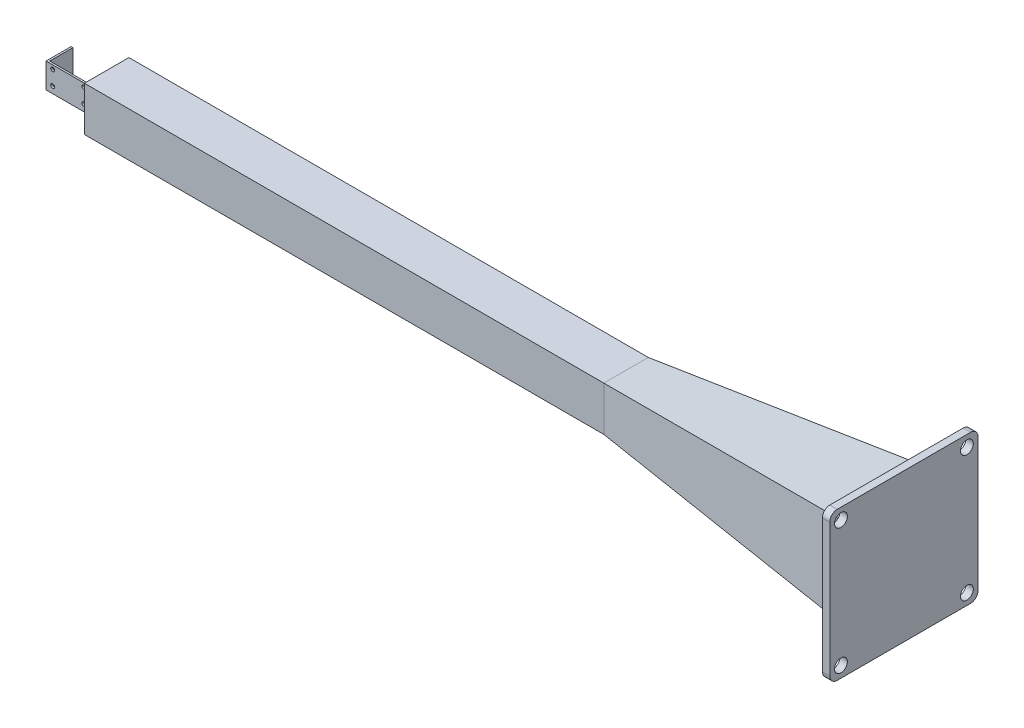
ISO-10303-21;
HEADER;
FILE_DESCRIPTION(('STEP AP214'),'2;1');
FILE_NAME('part.step','',(''),(''),'','','');
FILE_SCHEMA(('AUTOMOTIVE_DESIGN { 1 0 10303 214 1 1 1 1 }'));
ENDSEC;
DATA;
#1=APPLICATION_CONTEXT('core data for automotive mechanical design processes');
#2=APPLICATION_PROTOCOL_DEFINITION('international standard','automotive_design',2000,#1);
#3=PRODUCT_CONTEXT('',#1,'mechanical');
#4=PRODUCT('Part','Part','',(#3));
#5=PRODUCT_RELATED_PRODUCT_CATEGORY('part','',(#4));
#6=PRODUCT_DEFINITION_FORMATION('','',#4);
#7=PRODUCT_DEFINITION_CONTEXT('part definition',#1,'design');
#8=PRODUCT_DEFINITION('design','',#6,#7);
#9=PRODUCT_DEFINITION_SHAPE('','',#8);
#10=(LENGTH_UNIT() NAMED_UNIT(*) SI_UNIT(.MILLI.,.METRE.));
#11=(NAMED_UNIT(*) PLANE_ANGLE_UNIT() SI_UNIT($,.RADIAN.));
#12=(NAMED_UNIT(*) SI_UNIT($,.STERADIAN.) SOLID_ANGLE_UNIT());
#13=UNCERTAINTY_MEASURE_WITH_UNIT(LENGTH_MEASURE(1.E-05),#10,'distance_accuracy_value','');
#14=(GEOMETRIC_REPRESENTATION_CONTEXT(3) GLOBAL_UNCERTAINTY_ASSIGNED_CONTEXT((#13)) GLOBAL_UNIT_ASSIGNED_CONTEXT((#10,
#11,#12)) REPRESENTATION_CONTEXT('',''));
#15=CARTESIAN_POINT('',(0.,0.,0.));
#16=DIRECTION('',(0.,0.,1.));
#17=DIRECTION('',(1.,0.,0.));
#18=AXIS2_PLACEMENT_3D('',#15,#16,#17);
#19=CARTESIAN_POINT('',(4789.65051725586,111.232226359876,62.5));
#20=DIRECTION('',(0.,0.,1.));
#21=DIRECTION('',(0.,-1.,0.));
#22=AXIS2_PLACEMENT_3D('',#19,#20,#21);
#23=PLANE('',#22);
#24=DIRECTION('',(0.,-1.,0.));
#25=VECTOR('',#24,1.);
#26=CARTESIAN_POINT('',(2950.23926228632,111.232226359876,62.5));
#27=LINE('',#26,#25);
#28=CARTESIAN_POINT('',(2950.23926228632,111.232226359876,62.5));
#29=VERTEX_POINT('',#28);
#30=CARTESIAN_POINT('',(2950.23926228632,-128.767773640124,62.5));
#31=VERTEX_POINT('',#30);
#32=EDGE_CURVE('E311',#29,#31,#27,.T.);
#33=ORIENTED_EDGE('',*,*,#32,.F.);
#34=DIRECTION('',(-1.,0.,0.));
#35=VECTOR('',#34,1.);
#36=CARTESIAN_POINT('',(4789.65051725586,111.232226359876,62.5));
#37=LINE('',#36,#35);
#38=CARTESIAN_POINT('',(146.23926228632,111.232226359876,62.5));
#39=VERTEX_POINT('',#38);
#40=EDGE_CURVE('E57',#29,#39,#37,.T.);
#41=ORIENTED_EDGE('',*,*,#40,.T.);
#42=DIRECTION('',(0.,1.,0.));
#43=VECTOR('',#42,1.);
#44=CARTESIAN_POINT('',(146.23926228632,-128.767773640124,62.5));
#45=LINE('',#44,#43);
#46=CARTESIAN_POINT('',(146.23926228632,-128.767773640124,62.5));
#47=VERTEX_POINT('',#46);
#48=EDGE_CURVE('E321',#47,#39,#45,.T.);
#49=ORIENTED_EDGE('',*,*,#48,.F.);
#50=DIRECTION('',(-1.,0.,0.));
#51=VECTOR('',#50,1.);
#52=CARTESIAN_POINT('',(4789.65051725586,-128.767773640124,62.5));
#53=LINE('',#52,#51);
#54=EDGE_CURVE('E307',#31,#47,#53,.T.);
#55=ORIENTED_EDGE('',*,*,#54,.F.);
#56=EDGE_LOOP('',(#33,#41,#49,#55));
#57=FACE_BOUND('',#56,.T.);
#58=ADVANCED_FACE('F47',(#57),#23,.T.);
#59=CARTESIAN_POINT('',(4789.65051725586,-128.767773640124,-177.5));
#60=DIRECTION('',(0.,-1.,0.));
#61=DIRECTION('',(0.,0.,-1.));
#62=AXIS2_PLACEMENT_3D('',#59,#60,#61);
#63=PLANE('',#62);
#64=DIRECTION('',(0.,0.,-1.));
#65=VECTOR('',#64,1.);
#66=CARTESIAN_POINT('',(2950.23926228632,-128.767773640124,62.5));
#67=LINE('',#66,#65);
#68=CARTESIAN_POINT('',(2950.23926228632,-128.767773640124,-177.5));
#69=VERTEX_POINT('',#68);
#70=EDGE_CURVE('E299',#31,#69,#67,.T.);
#71=ORIENTED_EDGE('',*,*,#70,.F.);
#72=ORIENTED_EDGE('',*,*,#54,.T.);
#73=DIRECTION('',(0.,0.,1.));
#74=VECTOR('',#73,1.);
#75=CARTESIAN_POINT('',(146.23926228632,-128.767773640124,-177.5));
#76=LINE('',#75,#74);
#77=CARTESIAN_POINT('',(146.23926228632,-128.767773640124,-177.5));
#78=VERTEX_POINT('',#77);
#79=EDGE_CURVE('E453',#78,#47,#76,.T.);
#80=ORIENTED_EDGE('',*,*,#79,.F.);
#81=DIRECTION('',(-1.,0.,0.));
#82=VECTOR('',#81,1.);
#83=CARTESIAN_POINT('',(4789.65051725586,-128.767773640124,-177.5));
#84=LINE('',#83,#82);
#85=EDGE_CURVE('E309',#69,#78,#84,.T.);
#86=ORIENTED_EDGE('',*,*,#85,.F.);
#87=EDGE_LOOP('',(#71,#72,#80,#86));
#88=FACE_BOUND('',#87,.T.);
#89=ADVANCED_FACE('F305',(#88),#63,.T.);
#90=CARTESIAN_POINT('',(4789.65051725586,111.232226359876,-177.5));
#91=DIRECTION('',(0.,0.,-1.));
#92=DIRECTION('',(0.,1.,0.));
#93=AXIS2_PLACEMENT_3D('',#90,#91,#92);
#94=PLANE('',#93);
#95=DIRECTION('',(0.,1.,0.));
#96=VECTOR('',#95,1.);
#97=CARTESIAN_POINT('',(2950.23926228632,-128.767773640124,-177.5));
#98=LINE('',#97,#96);
#99=CARTESIAN_POINT('',(2950.23926228631,111.232226359876,-177.5));
#100=VERTEX_POINT('',#99);
#101=EDGE_CURVE('E310',#69,#100,#98,.T.);
#102=ORIENTED_EDGE('',*,*,#101,.F.);
#103=ORIENTED_EDGE('',*,*,#85,.T.);
#104=DIRECTION('',(0.,-1.,0.));
#105=VECTOR('',#104,1.);
#106=CARTESIAN_POINT('',(146.23926228632,111.232226359876,-177.5));
#107=LINE('',#106,#105);
#108=CARTESIAN_POINT('',(146.23926228632,111.232226359876,-177.5));
#109=VERTEX_POINT('',#108);
#110=EDGE_CURVE('E468',#109,#78,#107,.T.);
#111=ORIENTED_EDGE('',*,*,#110,.F.);
#112=DIRECTION('',(-1.,0.,0.));
#113=VECTOR('',#112,1.);
#114=CARTESIAN_POINT('',(4789.65051725586,111.232226359876,-177.5));
#115=LINE('',#114,#113);
#116=EDGE_CURVE('E471',#100,#109,#115,.T.);
#117=ORIENTED_EDGE('',*,*,#116,.F.);
#118=EDGE_LOOP('',(#102,#103,#111,#117));
#119=FACE_BOUND('',#118,.T.);
#120=ADVANCED_FACE('F483',(#119),#94,.T.);
#121=CARTESIAN_POINT('',(4789.65051725586,111.232226359876,-177.5));
#122=DIRECTION('',(0.,1.,0.));
#123=DIRECTION('',(0.,0.,1.));
#124=AXIS2_PLACEMENT_3D('',#121,#122,#123);
#125=PLANE('',#124);
#126=DIRECTION('',(0.,0.,1.));
#127=VECTOR('',#126,1.);
#128=CARTESIAN_POINT('',(2950.23926228632,111.232226359876,-177.5));
#129=LINE('',#128,#127);
#130=EDGE_CURVE('E324',#100,#29,#129,.T.);
#131=ORIENTED_EDGE('',*,*,#130,.F.);
#132=ORIENTED_EDGE('',*,*,#116,.T.);
#133=DIRECTION('',(0.,0.,-1.));
#134=VECTOR('',#133,1.);
#135=CARTESIAN_POINT('',(146.23926228632,111.232226359876,62.5));
#136=LINE('',#135,#134);
#137=EDGE_CURVE('E465',#39,#109,#136,.T.);
#138=ORIENTED_EDGE('',*,*,#137,.F.);
#139=ORIENTED_EDGE('',*,*,#40,.F.);
#140=EDGE_LOOP('',(#131,#132,#138,#139));
#141=FACE_BOUND('',#140,.T.);
#142=ADVANCED_FACE('F492',(#141),#125,.T.);
#143=CARTESIAN_POINT('',(146.23926228632,0.,0.));
#144=DIRECTION('',(-1.,0.,0.));
#145=DIRECTION('',(0.,0.,1.));
#146=AXIS2_PLACEMENT_3D('',#143,#144,#145);
#147=PLANE('',#146);
#148=DIRECTION('',(0.,0.,1.));
#149=VECTOR('',#148,1.);
#150=CARTESIAN_POINT('',(146.23926228632,-76.2677736401241,10.));
#151=LINE('',#150,#149);
#152=CARTESIAN_POINT('',(146.23926228632,-76.2677736401241,-125.));
#153=VERTEX_POINT('',#152);
#154=CARTESIAN_POINT('',(146.23926228632,-76.2677736401241,10.));
#155=VERTEX_POINT('',#154);
#156=EDGE_CURVE('E446',#153,#155,#151,.T.);
#157=ORIENTED_EDGE('',*,*,#156,.F.);
#158=DIRECTION('',(0.,-1.,0.));
#159=VECTOR('',#158,1.);
#160=CARTESIAN_POINT('',(146.23926228632,-76.2677736401241,-125.));
#161=LINE('',#160,#159);
#162=CARTESIAN_POINT('',(146.23926228632,58.7322263598759,-125.));
#163=VERTEX_POINT('',#162);
#164=EDGE_CURVE('E443',#163,#153,#161,.T.);
#165=ORIENTED_EDGE('',*,*,#164,.F.);
#166=DIRECTION('',(0.,0.,-1.));
#167=VECTOR('',#166,1.);
#168=CARTESIAN_POINT('',(146.23926228632,58.7322263598759,-125.));
#169=LINE('',#168,#167);
#170=CARTESIAN_POINT('',(146.23926228632,58.7322263598759,10.));
#171=VERTEX_POINT('',#170);
#172=EDGE_CURVE('E447',#171,#163,#169,.T.);
#173=ORIENTED_EDGE('',*,*,#172,.F.);
#174=DIRECTION('',(0.,1.,0.));
#175=VECTOR('',#174,1.);
#176=CARTESIAN_POINT('',(146.23926228632,58.7322263598759,10.));
#177=LINE('',#176,#175);
#178=EDGE_CURVE('E450',#155,#171,#177,.T.);
#179=ORIENTED_EDGE('',*,*,#178,.F.);
#180=EDGE_LOOP('',(#157,#165,#173,#179));
#181=FACE_BOUND('',#180,.T.);
#182=ORIENTED_EDGE('',*,*,#79,.T.);
#183=ORIENTED_EDGE('',*,*,#48,.T.);
#184=ORIENTED_EDGE('',*,*,#137,.T.);
#185=ORIENTED_EDGE('',*,*,#110,.T.);
#186=EDGE_LOOP('',(#182,#183,#184,#185));
#187=FACE_BOUND('',#186,.T.);
#188=ADVANCED_FACE('F498',(#181,#187),#147,.T.);
#189=CARTESIAN_POINT('',(337.158093206688,58.7322263598759,-125.));
#190=DIRECTION('',(0.,-1.,0.));
#191=DIRECTION('',(0.,0.,-1.));
#192=AXIS2_PLACEMENT_3D('',#189,#190,#191);
#193=PLANE('',#192);
#194=DIRECTION('',(-1.,0.,0.));
#195=VECTOR('',#194,1.);
#196=CARTESIAN_POINT('',(337.158093206688,58.7322263598759,10.));
#197=LINE('',#196,#195);
#198=CARTESIAN_POINT('',(-113.76073771368,58.7322263598759,10.));
#199=VERTEX_POINT('',#198);
#200=EDGE_CURVE('E434',#171,#199,#197,.T.);
#201=ORIENTED_EDGE('',*,*,#200,.F.);
#202=ORIENTED_EDGE('',*,*,#172,.T.);
#203=DIRECTION('',(-1.,0.,0.));
#204=VECTOR('',#203,1.);
#205=CARTESIAN_POINT('',(337.158093206688,58.7322263598759,-125.));
#206=LINE('',#205,#204);
#207=CARTESIAN_POINT('',(116.239262286321,58.7322263598759,-125.));
#208=VERTEX_POINT('',#207);
#209=EDGE_CURVE('E455',#163,#208,#206,.T.);
#210=ORIENTED_EDGE('',*,*,#209,.T.);
#211=DIRECTION('',(0.,0.,1.));
#212=VECTOR('',#211,1.);
#213=CARTESIAN_POINT('',(116.23926228632,58.7322263598759,-375.369863706809));
#214=LINE('',#213,#212);
#215=CARTESIAN_POINT('',(116.23926228632,58.7322263598759,0.));
#216=VERTEX_POINT('',#215);
#217=EDGE_CURVE('E418',#208,#216,#214,.T.);
#218=ORIENTED_EDGE('',*,*,#217,.T.);
#219=DIRECTION('',(-1.,0.,0.));
#220=VECTOR('',#219,1.);
#221=CARTESIAN_POINT('',(116.23926228632,58.7322263598759,0.));
#222=LINE('',#221,#220);
#223=CARTESIAN_POINT('',(-103.76073771368,58.7322263598759,0.));
#224=VERTEX_POINT('',#223);
#225=EDGE_CURVE('E423',#216,#224,#222,.T.);
#226=ORIENTED_EDGE('',*,*,#225,.T.);
#227=DIRECTION('',(0.,0.,-1.));
#228=VECTOR('',#227,1.);
#229=CARTESIAN_POINT('',(-103.76073771368,58.7322263598759,0.));
#230=LINE('',#229,#228);
#231=CARTESIAN_POINT('',(-103.76073771368,58.7322263598759,-125.));
#232=VERTEX_POINT('',#231);
#233=EDGE_CURVE('E419',#224,#232,#230,.T.);
#234=ORIENTED_EDGE('',*,*,#233,.T.);
#235=DIRECTION('',(1.,0.,0.));
#236=VECTOR('',#235,1.);
#237=CARTESIAN_POINT('',(-7073.76073771368,58.7322263598745,-125.));
#238=LINE('',#237,#236);
#239=CARTESIAN_POINT('',(-113.76073771368,58.7322263598759,-125.));
#240=VERTEX_POINT('',#239);
#241=EDGE_CURVE('E429',#240,#232,#238,.T.);
#242=ORIENTED_EDGE('',*,*,#241,.F.);
#243=DIRECTION('',(0.,0.,1.));
#244=VECTOR('',#243,1.);
#245=CARTESIAN_POINT('',(-113.76073771368,58.7322263598759,-240.));
#246=LINE('',#245,#244);
#247=EDGE_CURVE('E415',#240,#199,#246,.T.);
#248=ORIENTED_EDGE('',*,*,#247,.T.);
#249=EDGE_LOOP('',(#201,#202,#210,#218,#226,#234,#242,#248));
#250=FACE_BOUND('',#249,.T.);
#251=ADVANCED_FACE('F626',(#250),#193,.F.);
#252=CARTESIAN_POINT('',(337.158093206688,-76.2677736401241,-125.));
#253=DIRECTION('',(0.,0.,1.));
#254=DIRECTION('',(0.,-1.,0.));
#255=AXIS2_PLACEMENT_3D('',#252,#253,#254);
#256=PLANE('',#255);
#257=ORIENTED_EDGE('',*,*,#209,.F.);
#258=ORIENTED_EDGE('',*,*,#164,.T.);
#259=DIRECTION('',(-1.,0.,0.));
#260=VECTOR('',#259,1.);
#261=CARTESIAN_POINT('',(337.158093206688,-76.2677736401241,-125.));
#262=LINE('',#261,#260);
#263=CARTESIAN_POINT('',(116.239262286321,-76.2677736401241,-125.));
#264=VERTEX_POINT('',#263);
#265=EDGE_CURVE('E457',#153,#264,#262,.T.);
#266=ORIENTED_EDGE('',*,*,#265,.T.);
#267=DIRECTION('',(0.,-1.,0.));
#268=VECTOR('',#267,1.);
#269=CARTESIAN_POINT('',(116.23926228632,0.,-125.));
#270=LINE('',#269,#268);
#271=EDGE_CURVE('E422',#208,#264,#270,.T.);
#272=ORIENTED_EDGE('',*,*,#271,.F.);
#273=EDGE_LOOP('',(#257,#258,#266,#272));
#274=FACE_BOUND('',#273,.T.);
#275=ADVANCED_FACE('F636',(#274),#256,.F.);
#276=CARTESIAN_POINT('',(337.158093206688,-76.2677736401241,10.));
#277=DIRECTION('',(0.,1.,0.));
#278=DIRECTION('',(0.,0.,1.));
#279=AXIS2_PLACEMENT_3D('',#276,#277,#278);
#280=PLANE('',#279);
#281=ORIENTED_EDGE('',*,*,#265,.F.);
#282=ORIENTED_EDGE('',*,*,#156,.T.);
#283=DIRECTION('',(-1.,0.,0.));
#284=VECTOR('',#283,1.);
#285=CARTESIAN_POINT('',(337.158093206688,-76.2677736401241,10.));
#286=LINE('',#285,#284);
#287=CARTESIAN_POINT('',(-113.76073771368,-76.2677736401241,10.));
#288=VERTEX_POINT('',#287);
#289=EDGE_CURVE('E459',#155,#288,#286,.T.);
#290=ORIENTED_EDGE('',*,*,#289,.T.);
#291=DIRECTION('',(0.,0.,1.));
#292=VECTOR('',#291,1.);
#293=CARTESIAN_POINT('',(-113.76073771368,-76.2677736401241,-240.));
#294=LINE('',#293,#292);
#295=CARTESIAN_POINT('',(-113.76073771368,-76.2677736401241,-125.));
#296=VERTEX_POINT('',#295);
#297=EDGE_CURVE('E394',#296,#288,#294,.T.);
#298=ORIENTED_EDGE('',*,*,#297,.F.);
#299=DIRECTION('',(1.,0.,0.));
#300=VECTOR('',#299,1.);
#301=CARTESIAN_POINT('',(-7073.76073771368,-76.2677736401255,-125.));
#302=LINE('',#301,#300);
#303=CARTESIAN_POINT('',(-103.76073771368,-76.2677736401241,-125.));
#304=VERTEX_POINT('',#303);
#305=EDGE_CURVE('E410',#296,#304,#302,.T.);
#306=ORIENTED_EDGE('',*,*,#305,.T.);
#307=DIRECTION('',(0.,0.,-1.));
#308=VECTOR('',#307,1.);
#309=CARTESIAN_POINT('',(-103.76073771368,-76.2677736401241,-125.));
#310=LINE('',#309,#308);
#311=CARTESIAN_POINT('',(-103.76073771368,-76.2677736401241,0.));
#312=VERTEX_POINT('',#311);
#313=EDGE_CURVE('E383',#312,#304,#310,.T.);
#314=ORIENTED_EDGE('',*,*,#313,.F.);
#315=DIRECTION('',(-1.,0.,0.));
#316=VECTOR('',#315,1.);
#317=CARTESIAN_POINT('',(-103.76073771368,-76.2677736401241,0.));
#318=LINE('',#317,#316);
#319=CARTESIAN_POINT('',(116.239262286321,-76.2677736401241,0.));
#320=VERTEX_POINT('',#319);
#321=EDGE_CURVE('E388',#320,#312,#318,.T.);
#322=ORIENTED_EDGE('',*,*,#321,.F.);
#323=DIRECTION('',(0.,0.,1.));
#324=VECTOR('',#323,1.);
#325=CARTESIAN_POINT('',(116.239262286321,-76.2677736401241,0.));
#326=LINE('',#325,#324);
#327=EDGE_CURVE('E380',#264,#320,#326,.T.);
#328=ORIENTED_EDGE('',*,*,#327,.F.);
#329=EDGE_LOOP('',(#281,#282,#290,#298,#306,#314,#322,#328));
#330=FACE_BOUND('',#329,.T.);
#331=ADVANCED_FACE('F632',(#330),#280,.F.);
#332=CARTESIAN_POINT('',(337.158093206688,58.7322263598759,10.));
#333=DIRECTION('',(0.,0.,-1.));
#334=DIRECTION('',(-1.,0.,0.));
#335=AXIS2_PLACEMENT_3D('',#332,#333,#334);
#336=PLANE('',#335);
#337=ORIENTED_EDGE('',*,*,#289,.F.);
#338=ORIENTED_EDGE('',*,*,#178,.T.);
#339=ORIENTED_EDGE('',*,*,#200,.T.);
#340=DIRECTION('',(0.,-1.,0.));
#341=VECTOR('',#340,1.);
#342=CARTESIAN_POINT('',(-113.76073771368,-66.2677736401241,10.));
#343=LINE('',#342,#341);
#344=EDGE_CURVE('E371',#199,#288,#343,.T.);
#345=ORIENTED_EDGE('',*,*,#344,.T.);
#346=EDGE_LOOP('',(#337,#338,#339,#345));
#347=FACE_BOUND('',#346,.T.);
#348=CARTESIAN_POINT('',(90.2392622863204,-40.2677736401241,10.));
#349=DIRECTION('',(0.,0.,1.));
#350=DIRECTION('',(1.,0.,0.));
#351=AXIS2_PLACEMENT_3D('',#348,#349,#350);
#352=CIRCLE('',#351,10.5000000000005);
#353=CARTESIAN_POINT('',(100.739262286321,-40.2677736401241,10.));
#354=VERTEX_POINT('',#353);
#355=EDGE_CURVE('E400',#354,#354,#352,.T.);
#356=ORIENTED_EDGE('',*,*,#355,.F.);
#357=EDGE_LOOP('',(#356));
#358=FACE_BOUND('',#357,.T.);
#359=CARTESIAN_POINT('',(-77.7607377136796,37.7322263598759,10.));
#360=DIRECTION('',(0.,0.,1.));
#361=DIRECTION('',(1.,0.,0.));
#362=AXIS2_PLACEMENT_3D('',#359,#360,#361);
#363=CIRCLE('',#362,10.5000000000005);
#364=CARTESIAN_POINT('',(-67.260737713679,37.7322263598759,10.));
#365=VERTEX_POINT('',#364);
#366=EDGE_CURVE('E390',#365,#365,#363,.T.);
#367=ORIENTED_EDGE('',*,*,#366,.F.);
#368=EDGE_LOOP('',(#367));
#369=FACE_BOUND('',#368,.T.);
#370=CARTESIAN_POINT('',(-77.7607377136796,-40.2677736401236,10.));
#371=DIRECTION('',(0.,0.,1.));
#372=DIRECTION('',(1.,0.,0.));
#373=AXIS2_PLACEMENT_3D('',#370,#371,#372);
#374=CIRCLE('',#373,10.5000000000001);
#375=CARTESIAN_POINT('',(-67.2607377136795,-40.2677736401236,10.));
#376=VERTEX_POINT('',#375);
#377=EDGE_CURVE('E393',#376,#376,#374,.T.);
#378=ORIENTED_EDGE('',*,*,#377,.F.);
#379=EDGE_LOOP('',(#378));
#380=FACE_BOUND('',#379,.T.);
#381=CARTESIAN_POINT('',(90.2392622863204,37.7322263598759,10.));
#382=DIRECTION('',(0.,0.,1.));
#383=DIRECTION('',(1.,0.,0.));
#384=AXIS2_PLACEMENT_3D('',#381,#382,#383);
#385=CIRCLE('',#384,10.5000000000004);
#386=CARTESIAN_POINT('',(100.739262286321,37.7322263598759,10.));
#387=VERTEX_POINT('',#386);
#388=EDGE_CURVE('E405',#387,#387,#385,.T.);
#389=ORIENTED_EDGE('',*,*,#388,.F.);
#390=EDGE_LOOP('',(#389));
#391=FACE_BOUND('',#390,.T.);
#392=ADVANCED_FACE('F628',(#347,#358,#369,#380,#391),#336,.F.);
#393=CARTESIAN_POINT('',(0.,0.,0.));
#394=DIRECTION('',(0.,0.,1.));
#395=DIRECTION('',(1.,0.,0.));
#396=AXIS2_PLACEMENT_3D('',#393,#394,#395);
#397=PLANE('',#396);
#398=CARTESIAN_POINT('',(90.2392622863204,37.7322263598759,0.));
#399=DIRECTION('',(0.,0.,1.));
#400=DIRECTION('',(1.,0.,0.));
#401=AXIS2_PLACEMENT_3D('',#398,#399,#400);
#402=CIRCLE('',#401,10.5000000000004);
#403=CARTESIAN_POINT('',(100.739262286321,37.7322263598759,0.));
#404=VERTEX_POINT('',#403);
#405=EDGE_CURVE('E389',#404,#404,#402,.T.);
#406=ORIENTED_EDGE('',*,*,#405,.T.);
#407=EDGE_LOOP('',(#406));
#408=FACE_BOUND('',#407,.T.);
#409=CARTESIAN_POINT('',(-77.7607377136796,37.7322263598759,0.));
#410=DIRECTION('',(0.,0.,1.));
#411=DIRECTION('',(1.,0.,0.));
#412=AXIS2_PLACEMENT_3D('',#409,#410,#411);
#413=CIRCLE('',#412,10.5000000000005);
#414=CARTESIAN_POINT('',(-67.260737713679,37.7322263598759,0.));
#415=VERTEX_POINT('',#414);
#416=EDGE_CURVE('E385',#415,#415,#413,.T.);
#417=ORIENTED_EDGE('',*,*,#416,.T.);
#418=EDGE_LOOP('',(#417));
#419=FACE_BOUND('',#418,.T.);
#420=ORIENTED_EDGE('',*,*,#225,.F.);
#421=DIRECTION('',(0.,1.,0.));
#422=VECTOR('',#421,1.);
#423=CARTESIAN_POINT('',(116.23926228632,63.7322263598759,0.));
#424=LINE('',#423,#422);
#425=EDGE_CURVE('E377',#320,#216,#424,.T.);
#426=ORIENTED_EDGE('',*,*,#425,.F.);
#427=ORIENTED_EDGE('',*,*,#321,.T.);
#428=DIRECTION('',(0.,-1.,0.));
#429=VECTOR('',#428,1.);
#430=CARTESIAN_POINT('',(-103.76073771368,63.7322263598759,0.));
#431=LINE('',#430,#429);
#432=EDGE_CURVE('E381',#224,#312,#431,.T.);
#433=ORIENTED_EDGE('',*,*,#432,.F.);
#434=EDGE_LOOP('',(#420,#426,#427,#433));
#435=FACE_BOUND('',#434,.T.);
#436=CARTESIAN_POINT('',(-77.7607377136796,-40.2677736401236,0.));
#437=DIRECTION('',(0.,0.,1.));
#438=DIRECTION('',(1.,0.,0.));
#439=AXIS2_PLACEMENT_3D('',#436,#437,#438);
#440=CIRCLE('',#439,10.5000000000001);
#441=CARTESIAN_POINT('',(-67.2607377136795,-40.2677736401236,0.));
#442=VERTEX_POINT('',#441);
#443=EDGE_CURVE('E395',#442,#442,#440,.T.);
#444=ORIENTED_EDGE('',*,*,#443,.T.);
#445=EDGE_LOOP('',(#444));
#446=FACE_BOUND('',#445,.T.);
#447=CARTESIAN_POINT('',(90.2392622863204,-40.2677736401241,0.));
#448=DIRECTION('',(0.,0.,1.));
#449=DIRECTION('',(1.,0.,0.));
#450=AXIS2_PLACEMENT_3D('',#447,#448,#449);
#451=CIRCLE('',#450,10.5000000000005);
#452=CARTESIAN_POINT('',(100.739262286321,-40.2677736401241,0.));
#453=VERTEX_POINT('',#452);
#454=EDGE_CURVE('E384',#453,#453,#451,.T.);
#455=ORIENTED_EDGE('',*,*,#454,.T.);
#456=EDGE_LOOP('',(#455));
#457=FACE_BOUND('',#456,.T.);
#458=ADVANCED_FACE('F631',(#408,#419,#435,#446,#457),#397,.F.);
#459=CARTESIAN_POINT('',(-103.76073771368,63.7322263598759,-240.));
#460=DIRECTION('',(1.,0.,0.));
#461=DIRECTION('',(0.,0.,-1.));
#462=AXIS2_PLACEMENT_3D('',#459,#460,#461);
#463=PLANE('',#462);
#464=ORIENTED_EDGE('',*,*,#432,.T.);
#465=ORIENTED_EDGE('',*,*,#313,.T.);
#466=DIRECTION('',(0.,-1.,0.));
#467=VECTOR('',#466,1.);
#468=CARTESIAN_POINT('',(-103.76073771368,63.7322263598759,-125.));
#469=LINE('',#468,#467);
#470=EDGE_CURVE('E379',#232,#304,#469,.T.);
#471=ORIENTED_EDGE('',*,*,#470,.F.);
#472=ORIENTED_EDGE('',*,*,#233,.F.);
#473=EDGE_LOOP('',(#464,#465,#471,#472));
#474=FACE_BOUND('',#473,.T.);
#475=ADVANCED_FACE('F656',(#474),#463,.T.);
#476=CARTESIAN_POINT('',(-113.76073771368,-66.2677736401241,-240.));
#477=DIRECTION('',(-1.,0.,0.));
#478=DIRECTION('',(0.,0.,1.));
#479=AXIS2_PLACEMENT_3D('',#476,#477,#478);
#480=PLANE('',#479);
#481=DIRECTION('',(0.,1.,0.));
#482=VECTOR('',#481,1.);
#483=CARTESIAN_POINT('',(-113.76073771368,-66.2677736401241,-125.));
#484=LINE('',#483,#482);
#485=EDGE_CURVE('E427',#296,#240,#484,.T.);
#486=ORIENTED_EDGE('',*,*,#485,.F.);
#487=ORIENTED_EDGE('',*,*,#297,.T.);
#488=ORIENTED_EDGE('',*,*,#344,.F.);
#489=ORIENTED_EDGE('',*,*,#247,.F.);
#490=EDGE_LOOP('',(#486,#487,#488,#489));
#491=FACE_BOUND('',#490,.T.);
#492=ADVANCED_FACE('F652',(#491),#480,.T.);
#493=CARTESIAN_POINT('',(-77.7607377136796,37.7322263598759,10.));
#494=DIRECTION('',(0.,0.,-1.));
#495=DIRECTION('',(-1.,0.,0.));
#496=AXIS2_PLACEMENT_3D('',#493,#494,#495);
#497=CYLINDRICAL_SURFACE('',#496,10.5000000000005);
#498=ORIENTED_EDGE('',*,*,#366,.T.);
#499=EDGE_LOOP('',(#498));
#500=FACE_BOUND('',#499,.T.);
#501=ORIENTED_EDGE('',*,*,#416,.F.);
#502=EDGE_LOOP('',(#501));
#503=FACE_BOUND('',#502,.T.);
#504=ADVANCED_FACE('F655',(#500,#503),#497,.F.);
#505=CARTESIAN_POINT('',(-77.7607377136796,-40.2677736401236,10.));
#506=DIRECTION('',(0.,0.,-1.));
#507=DIRECTION('',(-1.,0.,0.));
#508=AXIS2_PLACEMENT_3D('',#505,#506,#507);
#509=CYLINDRICAL_SURFACE('',#508,10.5000000000001);
#510=ORIENTED_EDGE('',*,*,#377,.T.);
#511=EDGE_LOOP('',(#510));
#512=FACE_BOUND('',#511,.T.);
#513=ORIENTED_EDGE('',*,*,#443,.F.);
#514=EDGE_LOOP('',(#513));
#515=FACE_BOUND('',#514,.T.);
#516=ADVANCED_FACE('F667',(#512,#515),#509,.F.);
#517=CARTESIAN_POINT('',(90.2392622863204,-40.2677736401241,10.));
#518=DIRECTION('',(0.,0.,-1.));
#519=DIRECTION('',(-1.,0.,0.));
#520=AXIS2_PLACEMENT_3D('',#517,#518,#519);
#521=CYLINDRICAL_SURFACE('',#520,10.5000000000005);
#522=ORIENTED_EDGE('',*,*,#355,.T.);
#523=EDGE_LOOP('',(#522));
#524=FACE_BOUND('',#523,.T.);
#525=ORIENTED_EDGE('',*,*,#454,.F.);
#526=EDGE_LOOP('',(#525));
#527=FACE_BOUND('',#526,.T.);
#528=ADVANCED_FACE('F663',(#524,#527),#521,.F.);
#529=CARTESIAN_POINT('',(90.2392622863204,37.7322263598759,10.));
#530=DIRECTION('',(0.,0.,-1.));
#531=DIRECTION('',(-1.,0.,0.));
#532=AXIS2_PLACEMENT_3D('',#529,#530,#531);
#533=CYLINDRICAL_SURFACE('',#532,10.5000000000004);
#534=ORIENTED_EDGE('',*,*,#388,.T.);
#535=EDGE_LOOP('',(#534));
#536=FACE_BOUND('',#535,.T.);
#537=ORIENTED_EDGE('',*,*,#405,.F.);
#538=EDGE_LOOP('',(#537));
#539=FACE_BOUND('',#538,.T.);
#540=ADVANCED_FACE('F650',(#536,#539),#533,.F.);
#541=CARTESIAN_POINT('',(116.23926228632,0.,-375.369863706809));
#542=DIRECTION('',(1.,0.,0.));
#543=DIRECTION('',(0.,0.,-1.));
#544=AXIS2_PLACEMENT_3D('',#541,#542,#543);
#545=PLANE('',#544);
#546=ORIENTED_EDGE('',*,*,#271,.T.);
#547=ORIENTED_EDGE('',*,*,#327,.T.);
#548=ORIENTED_EDGE('',*,*,#425,.T.);
#549=ORIENTED_EDGE('',*,*,#217,.F.);
#550=EDGE_LOOP('',(#546,#547,#548,#549));
#551=FACE_BOUND('',#550,.T.);
#552=ADVANCED_FACE('F646',(#551),#545,.F.);
#553=CARTESIAN_POINT('',(-7073.76073771368,-2.05596856412066E-12,-125.));
#554=DIRECTION('',(0.,0.,1.));
#555=DIRECTION('',(1.,0.,0.));
#556=AXIS2_PLACEMENT_3D('',#553,#554,#555);
#557=PLANE('',#556);
#558=ORIENTED_EDGE('',*,*,#470,.T.);
#559=ORIENTED_EDGE('',*,*,#305,.F.);
#560=ORIENTED_EDGE('',*,*,#485,.T.);
#561=ORIENTED_EDGE('',*,*,#241,.T.);
#562=EDGE_LOOP('',(#558,#559,#560,#561));
#563=FACE_BOUND('',#562,.T.);
#564=ADVANCED_FACE('F343',(#563),#557,.F.);
#565=CARTESIAN_POINT('',(16.6180879318183,0.,-191.747168444057));
#566=DIRECTION('',(-0.086343007329147,0.,0.996265469182466));
#567=DIRECTION('',(0.996265469182466,0.,0.086343007329147));
#568=AXIS2_PLACEMENT_3D('',#565,#566,#567);
#569=PLANE('',#568);
#570=DIRECTION('',(0.,-1.,0.));
#571=VECTOR('',#570,1.);
#572=CARTESIAN_POINT('',(4410.23926228632,0.,189.033333333333));
#573=LINE('',#572,#571);
#574=CARTESIAN_POINT('',(4410.23926228632,237.765559693209,189.033333333333));
#575=VERTEX_POINT('',#574);
#576=CARTESIAN_POINT('',(4410.23926228632,-255.301106973457,189.033333333333));
#577=VERTEX_POINT('',#576);
#578=EDGE_CURVE('E72',#575,#577,#573,.T.);
#579=ORIENTED_EDGE('',*,*,#578,.F.);
#580=DIRECTION('',(-0.992572468431404,-0.0860229472640551,-0.086022947264055));
#581=VECTOR('',#580,1.);
#582=CARTESIAN_POINT('',(4450.23926228632,241.232226359876,192.5));
#583=LINE('',#582,#581);
#584=EDGE_CURVE('E284',#575,#29,#583,.T.);
#585=ORIENTED_EDGE('',*,*,#584,.T.);
#586=ORIENTED_EDGE('',*,*,#32,.T.);
#587=DIRECTION('',(-0.992572468431404,0.086022947264055,-0.086022947264055));
#588=VECTOR('',#587,1.);
#589=CARTESIAN_POINT('',(4450.23926228632,-258.767773640124,192.5));
#590=LINE('',#589,#588);
#591=EDGE_CURVE('E51',#577,#31,#590,.T.);
#592=ORIENTED_EDGE('',*,*,#591,.F.);
#593=EDGE_LOOP('',(#579,#585,#586,#592));
#594=FACE_BOUND('',#593,.T.);
#595=ADVANCED_FACE('F323',(#594),#569,.T.);
#596=CARTESIAN_POINT('',(10.9176971515349,125.973428671557,0.));
#597=DIRECTION('',(-0.086343007329147,-0.996265469182466,0.));
#598=DIRECTION('',(0.996265469182466,-0.086343007329147,0.));
#599=AXIS2_PLACEMENT_3D('',#596,#597,#598);
#600=PLANE('',#599);
#601=DIRECTION('',(0.,0.,-1.));
#602=VECTOR('',#601,1.);
#603=CARTESIAN_POINT('',(4410.23926228632,-255.301106973457,0.));
#604=LINE('',#603,#602);
#605=CARTESIAN_POINT('',(4410.23926228632,-255.301106973457,-304.033333333333));
#606=VERTEX_POINT('',#605);
#607=EDGE_CURVE('E65',#577,#606,#604,.T.);
#608=ORIENTED_EDGE('',*,*,#607,.F.);
#609=ORIENTED_EDGE('',*,*,#591,.T.);
#610=ORIENTED_EDGE('',*,*,#70,.T.);
#611=DIRECTION('',(-0.992572468431404,0.086022947264055,0.0860229472640551));
#612=VECTOR('',#611,1.);
#613=CARTESIAN_POINT('',(4450.23926228632,-258.767773640124,-307.5));
#614=LINE('',#613,#612);
#615=EDGE_CURVE('E292',#606,#69,#614,.T.);
#616=ORIENTED_EDGE('',*,*,#615,.F.);
#617=EDGE_LOOP('',(#608,#609,#610,#616));
#618=FACE_BOUND('',#617,.T.);
#619=ADVANCED_FACE('F298',(#618),#600,.T.);
#620=CARTESIAN_POINT('',(12.4261146907508,-143.37824643174,0.));
#621=DIRECTION('',(-0.0863430073291471,0.996265469182466,0.));
#622=DIRECTION('',(-0.996265469182466,-0.0863430073291471,0.));
#623=AXIS2_PLACEMENT_3D('',#620,#621,#622);
#624=PLANE('',#623);
#625=DIRECTION('',(0.,0.,1.));
#626=VECTOR('',#625,1.);
#627=CARTESIAN_POINT('',(4410.23926228632,237.765559693209,0.));
#628=LINE('',#627,#626);
#629=CARTESIAN_POINT('',(4410.23926228632,237.765559693209,-304.033333333333));
#630=VERTEX_POINT('',#629);
#631=EDGE_CURVE('E268',#630,#575,#628,.T.);
#632=ORIENTED_EDGE('',*,*,#631,.F.);
#633=DIRECTION('',(-0.992572468431404,-0.0860229472640551,0.086022947264055));
#634=VECTOR('',#633,1.);
#635=CARTESIAN_POINT('',(4450.23926228632,241.232226359876,-307.5));
#636=LINE('',#635,#634);
#637=EDGE_CURVE('E290',#630,#100,#636,.T.);
#638=ORIENTED_EDGE('',*,*,#637,.T.);
#639=ORIENTED_EDGE('',*,*,#130,.T.);
#640=ORIENTED_EDGE('',*,*,#584,.F.);
#641=EDGE_LOOP('',(#632,#638,#639,#640));
#642=FACE_BOUND('',#641,.T.);
#643=ADVANCED_FACE('F348',(#642),#624,.T.);
#644=CARTESIAN_POINT('',(6.72572391046752,0.,77.6045066592406));
#645=DIRECTION('',(-0.0863430073291471,0.,-0.996265469182466));
#646=DIRECTION('',(-0.996265469182466,0.,0.0863430073291471));
#647=AXIS2_PLACEMENT_3D('',#644,#645,#646);
#648=PLANE('',#647);
#649=DIRECTION('',(0.,1.,0.));
#650=VECTOR('',#649,1.);
#651=CARTESIAN_POINT('',(4410.23926228632,0.,-304.033333333333));
#652=LINE('',#651,#650);
#653=EDGE_CURVE('E12',#606,#630,#652,.T.);
#654=ORIENTED_EDGE('',*,*,#653,.F.);
#655=ORIENTED_EDGE('',*,*,#615,.T.);
#656=ORIENTED_EDGE('',*,*,#101,.T.);
#657=ORIENTED_EDGE('',*,*,#637,.F.);
#658=EDGE_LOOP('',(#654,#655,#656,#657));
#659=FACE_BOUND('',#658,.T.);
#660=ADVANCED_FACE('F352',(#659),#648,.T.);
#661=CARTESIAN_POINT('',(4410.23926228632,351.232226359876,302.5));
#662=DIRECTION('',(1.,0.,0.));
#663=DIRECTION('',(0.,0.,-1.));
#664=AXIS2_PLACEMENT_3D('',#661,#662,#663);
#665=CYLINDRICAL_SURFACE('',#664,40.);
#666=CARTESIAN_POINT('',(4450.23926228632,351.232226359876,302.5));
#667=DIRECTION('',(1.,0.,0.));
#668=DIRECTION('',(0.,0.,1.));
#669=AXIS2_PLACEMENT_3D('',#666,#667,#668);
#670=CIRCLE('',#669,40.);
#671=CARTESIAN_POINT('',(4450.23926228632,391.232226359876,302.5));
#672=VERTEX_POINT('',#671);
#673=CARTESIAN_POINT('',(4450.23926228632,351.232226359876,342.5));
#674=VERTEX_POINT('',#673);
#675=EDGE_CURVE('E249',#672,#674,#670,.T.);
#676=ORIENTED_EDGE('',*,*,#675,.F.);
#677=DIRECTION('',(1.,0.,0.));
#678=VECTOR('',#677,1.);
#679=CARTESIAN_POINT('',(4410.23926228632,391.232226359876,302.5));
#680=LINE('',#679,#678);
#681=CARTESIAN_POINT('',(4410.23926228632,391.232226359876,302.5));
#682=VERTEX_POINT('',#681);
#683=EDGE_CURVE('E225',#682,#672,#680,.T.);
#684=ORIENTED_EDGE('',*,*,#683,.F.);
#685=CARTESIAN_POINT('',(4410.23926228632,351.232226359876,302.5));
#686=DIRECTION('',(1.,0.,0.));
#687=DIRECTION('',(0.,0.,1.));
#688=AXIS2_PLACEMENT_3D('',#685,#686,#687);
#689=CIRCLE('',#688,40.);
#690=CARTESIAN_POINT('',(4410.23926228632,351.232226359876,342.5));
#691=VERTEX_POINT('',#690);
#692=EDGE_CURVE('E218',#682,#691,#689,.T.);
#693=ORIENTED_EDGE('',*,*,#692,.T.);
#694=DIRECTION('',(1.,0.,0.));
#695=VECTOR('',#694,1.);
#696=CARTESIAN_POINT('',(4410.23926228632,351.232226359876,342.5));
#697=LINE('',#696,#695);
#698=EDGE_CURVE('E200',#691,#674,#697,.T.);
#699=ORIENTED_EDGE('',*,*,#698,.T.);
#700=EDGE_LOOP('',(#676,#684,#693,#699));
#701=FACE_BOUND('',#700,.T.);
#702=ADVANCED_FACE('F224',(#701),#665,.T.);
#703=CARTESIAN_POINT('',(4410.23926228632,391.232226359876,-417.5));
#704=DIRECTION('',(0.,1.,0.));
#705=DIRECTION('',(0.,0.,1.));
#706=AXIS2_PLACEMENT_3D('',#703,#704,#705);
#707=PLANE('',#706);
#708=DIRECTION('',(0.,0.,1.));
#709=VECTOR('',#708,1.);
#710=CARTESIAN_POINT('',(4450.23926228632,391.232226359876,-417.5));
#711=LINE('',#710,#709);
#712=CARTESIAN_POINT('',(4450.23926228632,391.232226359876,-417.5));
#713=VERTEX_POINT('',#712);
#714=EDGE_CURVE('E226',#713,#672,#711,.T.);
#715=ORIENTED_EDGE('',*,*,#714,.F.);
#716=DIRECTION('',(1.,0.,0.));
#717=VECTOR('',#716,1.);
#718=CARTESIAN_POINT('',(4410.23926228632,391.232226359876,-417.5));
#719=LINE('',#718,#717);
#720=CARTESIAN_POINT('',(4410.23926228632,391.232226359876,-417.5));
#721=VERTEX_POINT('',#720);
#722=EDGE_CURVE('E269',#721,#713,#719,.T.);
#723=ORIENTED_EDGE('',*,*,#722,.F.);
#724=DIRECTION('',(0.,0.,1.));
#725=VECTOR('',#724,1.);
#726=CARTESIAN_POINT('',(4410.23926228632,391.232226359876,-417.5));
#727=LINE('',#726,#725);
#728=EDGE_CURVE('E211',#721,#682,#727,.T.);
#729=ORIENTED_EDGE('',*,*,#728,.T.);
#730=ORIENTED_EDGE('',*,*,#683,.T.);
#731=EDGE_LOOP('',(#715,#723,#729,#730));
#732=FACE_BOUND('',#731,.T.);
#733=ADVANCED_FACE('F580',(#732),#707,.T.);
#734=CARTESIAN_POINT('',(4410.23926228632,351.232226359876,-417.5));
#735=DIRECTION('',(1.,0.,0.));
#736=DIRECTION('',(0.,0.,-1.));
#737=AXIS2_PLACEMENT_3D('',#734,#735,#736);
#738=CYLINDRICAL_SURFACE('',#737,40.);
#739=CARTESIAN_POINT('',(4450.23926228632,351.232226359876,-417.5));
#740=DIRECTION('',(1.,0.,0.));
#741=DIRECTION('',(0.,0.,-1.));
#742=AXIS2_PLACEMENT_3D('',#739,#740,#741);
#743=CIRCLE('',#742,40.);
#744=CARTESIAN_POINT('',(4450.23926228632,351.232226359876,-457.5));
#745=VERTEX_POINT('',#744);
#746=EDGE_CURVE('E229',#745,#713,#743,.T.);
#747=ORIENTED_EDGE('',*,*,#746,.F.);
#748=DIRECTION('',(1.,0.,0.));
#749=VECTOR('',#748,1.);
#750=CARTESIAN_POINT('',(4410.23926228632,351.232226359876,-457.5));
#751=LINE('',#750,#749);
#752=CARTESIAN_POINT('',(4410.23926228632,351.232226359876,-457.5));
#753=VERTEX_POINT('',#752);
#754=EDGE_CURVE('E271',#753,#745,#751,.T.);
#755=ORIENTED_EDGE('',*,*,#754,.F.);
#756=CARTESIAN_POINT('',(4410.23926228632,351.232226359876,-417.5));
#757=DIRECTION('',(1.,0.,0.));
#758=DIRECTION('',(0.,0.,-1.));
#759=AXIS2_PLACEMENT_3D('',#756,#757,#758);
#760=CIRCLE('',#759,40.);
#761=EDGE_CURVE('E245',#753,#721,#760,.T.);
#762=ORIENTED_EDGE('',*,*,#761,.T.);
#763=ORIENTED_EDGE('',*,*,#722,.T.);
#764=EDGE_LOOP('',(#747,#755,#762,#763));
#765=FACE_BOUND('',#764,.T.);
#766=ADVANCED_FACE('F779',(#765),#738,.T.);
#767=CARTESIAN_POINT('',(4410.23926228632,-368.767773640124,-457.5));
#768=DIRECTION('',(0.,0.,-1.));
#769=DIRECTION('',(-1.,0.,0.));
#770=AXIS2_PLACEMENT_3D('',#767,#768,#769);
#771=PLANE('',#770);
#772=DIRECTION('',(0.,1.,0.));
#773=VECTOR('',#772,1.);
#774=CARTESIAN_POINT('',(4450.23926228632,-368.767773640124,-457.5));
#775=LINE('',#774,#773);
#776=CARTESIAN_POINT('',(4450.23926228632,-368.767773640124,-457.5));
#777=VERTEX_POINT('',#776);
#778=EDGE_CURVE('E262',#777,#745,#775,.T.);
#779=ORIENTED_EDGE('',*,*,#778,.F.);
#780=DIRECTION('',(1.,0.,0.));
#781=VECTOR('',#780,1.);
#782=CARTESIAN_POINT('',(4410.23926228632,-368.767773640124,-457.5));
#783=LINE('',#782,#781);
#784=CARTESIAN_POINT('',(4410.23926228632,-368.767773640124,-457.5));
#785=VERTEX_POINT('',#784);
#786=EDGE_CURVE('E273',#785,#777,#783,.T.);
#787=ORIENTED_EDGE('',*,*,#786,.F.);
#788=DIRECTION('',(0.,1.,0.));
#789=VECTOR('',#788,1.);
#790=CARTESIAN_POINT('',(4410.23926228632,-368.767773640124,-457.5));
#791=LINE('',#790,#789);
#792=EDGE_CURVE('E242',#785,#753,#791,.T.);
#793=ORIENTED_EDGE('',*,*,#792,.T.);
#794=ORIENTED_EDGE('',*,*,#754,.T.);
#795=EDGE_LOOP('',(#779,#787,#793,#794));
#796=FACE_BOUND('',#795,.T.);
#797=ADVANCED_FACE('F587',(#796),#771,.T.);
#798=CARTESIAN_POINT('',(4410.23926228632,-368.767773640124,-417.5));
#799=DIRECTION('',(1.,0.,0.));
#800=DIRECTION('',(0.,0.,-1.));
#801=AXIS2_PLACEMENT_3D('',#798,#799,#800);
#802=CYLINDRICAL_SURFACE('',#801,40.);
#803=CARTESIAN_POINT('',(4450.23926228632,-368.767773640124,-417.5));
#804=DIRECTION('',(1.,0.,0.));
#805=DIRECTION('',(0.,0.,1.));
#806=AXIS2_PLACEMENT_3D('',#803,#804,#805);
#807=CIRCLE('',#806,40.);
#808=CARTESIAN_POINT('',(4450.23926228632,-408.767773640124,-417.5));
#809=VERTEX_POINT('',#808);
#810=EDGE_CURVE('E259',#809,#777,#807,.T.);
#811=ORIENTED_EDGE('',*,*,#810,.F.);
#812=DIRECTION('',(1.,0.,0.));
#813=VECTOR('',#812,1.);
#814=CARTESIAN_POINT('',(4410.23926228632,-408.767773640124,-417.5));
#815=LINE('',#814,#813);
#816=CARTESIAN_POINT('',(4410.23926228632,-408.767773640124,-417.5));
#817=VERTEX_POINT('',#816);
#818=EDGE_CURVE('E275',#817,#809,#815,.T.);
#819=ORIENTED_EDGE('',*,*,#818,.F.);
#820=CARTESIAN_POINT('',(4410.23926228632,-368.767773640124,-417.5));
#821=DIRECTION('',(1.,0.,0.));
#822=DIRECTION('',(0.,0.,1.));
#823=AXIS2_PLACEMENT_3D('',#820,#821,#822);
#824=CIRCLE('',#823,40.);
#825=EDGE_CURVE('E239',#817,#785,#824,.T.);
#826=ORIENTED_EDGE('',*,*,#825,.T.);
#827=ORIENTED_EDGE('',*,*,#786,.T.);
#828=EDGE_LOOP('',(#811,#819,#826,#827));
#829=FACE_BOUND('',#828,.T.);
#830=ADVANCED_FACE('F590',(#829),#802,.T.);
#831=CARTESIAN_POINT('',(4410.23926228632,-408.767773640124,-417.5));
#832=DIRECTION('',(0.,-1.,0.));
#833=DIRECTION('',(0.,0.,-1.));
#834=AXIS2_PLACEMENT_3D('',#831,#832,#833);
#835=PLANE('',#834);
#836=DIRECTION('',(0.,0.,-1.));
#837=VECTOR('',#836,1.);
#838=CARTESIAN_POINT('',(4450.23926228632,-408.767773640124,-417.5));
#839=LINE('',#838,#837);
#840=CARTESIAN_POINT('',(4450.23926228632,-408.767773640124,302.5));
#841=VERTEX_POINT('',#840);
#842=EDGE_CURVE('E256',#841,#809,#839,.T.);
#843=ORIENTED_EDGE('',*,*,#842,.F.);
#844=DIRECTION('',(1.,0.,0.));
#845=VECTOR('',#844,1.);
#846=CARTESIAN_POINT('',(4410.23926228632,-408.767773640124,302.5));
#847=LINE('',#846,#845);
#848=CARTESIAN_POINT('',(4410.23926228632,-408.767773640124,302.5));
#849=VERTEX_POINT('',#848);
#850=EDGE_CURVE('E277',#849,#841,#847,.T.);
#851=ORIENTED_EDGE('',*,*,#850,.F.);
#852=DIRECTION('',(0.,0.,-1.));
#853=VECTOR('',#852,1.);
#854=CARTESIAN_POINT('',(4410.23926228632,-408.767773640124,-417.5));
#855=LINE('',#854,#853);
#856=EDGE_CURVE('E236',#849,#817,#855,.T.);
#857=ORIENTED_EDGE('',*,*,#856,.T.);
#858=ORIENTED_EDGE('',*,*,#818,.T.);
#859=EDGE_LOOP('',(#843,#851,#857,#858));
#860=FACE_BOUND('',#859,.T.);
#861=ADVANCED_FACE('F593',(#860),#835,.T.);
#862=CARTESIAN_POINT('',(4410.23926228632,-368.767773640124,302.5));
#863=DIRECTION('',(1.,0.,0.));
#864=DIRECTION('',(0.,0.,-1.));
#865=AXIS2_PLACEMENT_3D('',#862,#863,#864);
#866=CYLINDRICAL_SURFACE('',#865,40.);
#867=CARTESIAN_POINT('',(4450.23926228632,-368.767773640124,302.5));
#868=DIRECTION('',(1.,0.,0.));
#869=DIRECTION('',(0.,0.,1.));
#870=AXIS2_PLACEMENT_3D('',#867,#868,#869);
#871=CIRCLE('',#870,40.);
#872=CARTESIAN_POINT('',(4450.23926228632,-368.767773640124,342.5));
#873=VERTEX_POINT('',#872);
#874=EDGE_CURVE('E253',#873,#841,#871,.T.);
#875=ORIENTED_EDGE('',*,*,#874,.F.);
#876=DIRECTION('',(1.,0.,0.));
#877=VECTOR('',#876,1.);
#878=CARTESIAN_POINT('',(4410.23926228632,-368.767773640124,342.5));
#879=LINE('',#878,#877);
#880=CARTESIAN_POINT('',(4410.23926228632,-368.767773640124,342.5));
#881=VERTEX_POINT('',#880);
#882=EDGE_CURVE('E210',#881,#873,#879,.T.);
#883=ORIENTED_EDGE('',*,*,#882,.F.);
#884=CARTESIAN_POINT('',(4410.23926228632,-368.767773640124,302.5));
#885=DIRECTION('',(1.,0.,0.));
#886=DIRECTION('',(0.,0.,1.));
#887=AXIS2_PLACEMENT_3D('',#884,#885,#886);
#888=CIRCLE('',#887,40.);
#889=EDGE_CURVE('E222',#881,#849,#888,.T.);
#890=ORIENTED_EDGE('',*,*,#889,.T.);
#891=ORIENTED_EDGE('',*,*,#850,.T.);
#892=EDGE_LOOP('',(#875,#883,#890,#891));
#893=FACE_BOUND('',#892,.T.);
#894=ADVANCED_FACE('F596',(#893),#866,.T.);
#895=CARTESIAN_POINT('',(4410.23926228632,-368.767773640124,342.5));
#896=DIRECTION('',(0.,0.,1.));
#897=DIRECTION('',(1.,0.,0.));
#898=AXIS2_PLACEMENT_3D('',#895,#896,#897);
#899=PLANE('',#898);
#900=DIRECTION('',(0.,-1.,0.));
#901=VECTOR('',#900,1.);
#902=CARTESIAN_POINT('',(4450.23926228632,-368.767773640124,342.5));
#903=LINE('',#902,#901);
#904=EDGE_CURVE('E205',#674,#873,#903,.T.);
#905=ORIENTED_EDGE('',*,*,#904,.F.);
#906=ORIENTED_EDGE('',*,*,#698,.F.);
#907=DIRECTION('',(0.,-1.,0.));
#908=VECTOR('',#907,1.);
#909=CARTESIAN_POINT('',(4410.23926228632,-368.767773640124,342.5));
#910=LINE('',#909,#908);
#911=EDGE_CURVE('E203',#691,#881,#910,.T.);
#912=ORIENTED_EDGE('',*,*,#911,.T.);
#913=ORIENTED_EDGE('',*,*,#882,.T.);
#914=EDGE_LOOP('',(#905,#906,#912,#913));
#915=FACE_BOUND('',#914,.T.);
#916=ADVANCED_FACE('F202',(#915),#899,.T.);
#917=CARTESIAN_POINT('',(4410.23926228632,351.232226359876,302.5));
#918=DIRECTION('',(-1.,0.,0.));
#919=DIRECTION('',(0.,0.,1.));
#920=AXIS2_PLACEMENT_3D('',#917,#918,#919);
#921=PLANE('',#920);
#922=ORIENTED_EDGE('',*,*,#631,.T.);
#923=ORIENTED_EDGE('',*,*,#578,.T.);
#924=ORIENTED_EDGE('',*,*,#607,.T.);
#925=ORIENTED_EDGE('',*,*,#653,.T.);
#926=EDGE_LOOP('',(#922,#923,#924,#925));
#927=FACE_BOUND('',#926,.T.);
#928=CARTESIAN_POINT('',(4410.23926228632,331.128149959019,-397.395923599143));
#929=DIRECTION('',(1.,0.,0.));
#930=DIRECTION('',(0.,0.,1.));
#931=AXIS2_PLACEMENT_3D('',#928,#929,#930);
#932=CIRCLE('',#931,34.7574717246391);
#933=CARTESIAN_POINT('',(4410.23926228632,331.128149959019,-362.638451874504));
#934=VERTEX_POINT('',#933);
#935=EDGE_CURVE('E540',#934,#934,#932,.T.);
#936=ORIENTED_EDGE('',*,*,#935,.T.);
#937=EDGE_LOOP('',(#936));
#938=FACE_BOUND('',#937,.T.);
#939=CARTESIAN_POINT('',(4410.23926228632,331.128149959019,282.395923599143));
#940=DIRECTION('',(1.,0.,0.));
#941=DIRECTION('',(0.,0.,-1.));
#942=AXIS2_PLACEMENT_3D('',#939,#940,#941);
#943=CIRCLE('',#942,34.7574717246391);
#944=CARTESIAN_POINT('',(4410.23926228632,331.128149959019,247.638451874504));
#945=VERTEX_POINT('',#944);
#946=EDGE_CURVE('E544',#945,#945,#943,.T.);
#947=ORIENTED_EDGE('',*,*,#946,.T.);
#948=EDGE_LOOP('',(#947));
#949=FACE_BOUND('',#948,.T.);
#950=CARTESIAN_POINT('',(4410.23926228632,-348.663697239267,282.395923599143));
#951=DIRECTION('',(1.,0.,0.));
#952=DIRECTION('',(0.,0.,1.));
#953=AXIS2_PLACEMENT_3D('',#950,#951,#952);
#954=CIRCLE('',#953,34.7574717246391);
#955=CARTESIAN_POINT('',(4410.23926228632,-348.663697239267,317.153395323782));
#956=VERTEX_POINT('',#955);
#957=EDGE_CURVE('E548',#956,#956,#954,.T.);
#958=ORIENTED_EDGE('',*,*,#957,.T.);
#959=EDGE_LOOP('',(#958));
#960=FACE_BOUND('',#959,.T.);
#961=CARTESIAN_POINT('',(4410.23926228632,-348.663697239267,-397.395923599143));
#962=DIRECTION('',(1.,0.,0.));
#963=DIRECTION('',(0.,0.,-1.));
#964=AXIS2_PLACEMENT_3D('',#961,#962,#963);
#965=CIRCLE('',#964,34.7574717246391);
#966=CARTESIAN_POINT('',(4410.23926228632,-348.663697239267,-432.153395323783));
#967=VERTEX_POINT('',#966);
#968=EDGE_CURVE('E251',#967,#967,#965,.T.);
#969=ORIENTED_EDGE('',*,*,#968,.T.);
#970=EDGE_LOOP('',(#969));
#971=FACE_BOUND('',#970,.T.);
#972=ORIENTED_EDGE('',*,*,#692,.F.);
#973=ORIENTED_EDGE('',*,*,#728,.F.);
#974=ORIENTED_EDGE('',*,*,#761,.F.);
#975=ORIENTED_EDGE('',*,*,#792,.F.);
#976=ORIENTED_EDGE('',*,*,#825,.F.);
#977=ORIENTED_EDGE('',*,*,#856,.F.);
#978=ORIENTED_EDGE('',*,*,#889,.F.);
#979=ORIENTED_EDGE('',*,*,#911,.F.);
#980=EDGE_LOOP('',(#972,#973,#974,#975,#976,#977,#978,#979));
#981=FACE_BOUND('',#980,.T.);
#982=ADVANCED_FACE('F216',(#927,#938,#949,#960,#971,#981),#921,.T.);
#983=CARTESIAN_POINT('',(4410.23926228632,-348.663697239267,-397.395923599143));
#984=DIRECTION('',(1.,0.,0.));
#985=DIRECTION('',(0.,0.,-1.));
#986=AXIS2_PLACEMENT_3D('',#983,#984,#985);
#987=CYLINDRICAL_SURFACE('',#986,34.7574717246391);
#988=ORIENTED_EDGE('',*,*,#968,.F.);
#989=EDGE_LOOP('',(#988));
#990=FACE_BOUND('',#989,.T.);
#991=CARTESIAN_POINT('',(4450.23926228632,-348.663697239267,-397.395923599143));
#992=DIRECTION('',(1.,0.,0.));
#993=DIRECTION('',(0.,0.,-1.));
#994=AXIS2_PLACEMENT_3D('',#991,#992,#993);
#995=CIRCLE('',#994,34.7574717246391);
#996=CARTESIAN_POINT('',(4450.23926228632,-348.663697239267,-432.153395323783));
#997=VERTEX_POINT('',#996);
#998=EDGE_CURVE('E232',#997,#997,#995,.T.);
#999=ORIENTED_EDGE('',*,*,#998,.T.);
#1000=EDGE_LOOP('',(#999));
#1001=FACE_BOUND('',#1000,.T.);
#1002=ADVANCED_FACE('F535',(#990,#1001),#987,.F.);
#1003=CARTESIAN_POINT('',(4410.23926228632,-348.663697239267,282.395923599143));
#1004=DIRECTION('',(1.,0.,0.));
#1005=DIRECTION('',(0.,0.,-1.));
#1006=AXIS2_PLACEMENT_3D('',#1003,#1004,#1005);
#1007=CYLINDRICAL_SURFACE('',#1006,34.7574717246391);
#1008=ORIENTED_EDGE('',*,*,#957,.F.);
#1009=EDGE_LOOP('',(#1008));
#1010=FACE_BOUND('',#1009,.T.);
#1011=CARTESIAN_POINT('',(4450.23926228632,-348.663697239267,282.395923599143));
#1012=DIRECTION('',(1.,0.,0.));
#1013=DIRECTION('',(0.,0.,1.));
#1014=AXIS2_PLACEMENT_3D('',#1011,#1012,#1013);
#1015=CIRCLE('',#1014,34.7574717246391);
#1016=CARTESIAN_POINT('',(4450.23926228632,-348.663697239267,317.153395323782));
#1017=VERTEX_POINT('',#1016);
#1018=EDGE_CURVE('E554',#1017,#1017,#1015,.T.);
#1019=ORIENTED_EDGE('',*,*,#1018,.T.);
#1020=EDGE_LOOP('',(#1019));
#1021=FACE_BOUND('',#1020,.T.);
#1022=ADVANCED_FACE('F827',(#1010,#1021),#1007,.F.);
#1023=CARTESIAN_POINT('',(4410.23926228632,331.128149959019,282.395923599143));
#1024=DIRECTION('',(1.,0.,0.));
#1025=DIRECTION('',(0.,0.,-1.));
#1026=AXIS2_PLACEMENT_3D('',#1023,#1024,#1025);
#1027=CYLINDRICAL_SURFACE('',#1026,34.7574717246391);
#1028=ORIENTED_EDGE('',*,*,#946,.F.);
#1029=EDGE_LOOP('',(#1028));
#1030=FACE_BOUND('',#1029,.T.);
#1031=CARTESIAN_POINT('',(4450.23926228632,331.128149959019,282.395923599143));
#1032=DIRECTION('',(1.,0.,0.));
#1033=DIRECTION('',(0.,0.,-1.));
#1034=AXIS2_PLACEMENT_3D('',#1031,#1032,#1033);
#1035=CIRCLE('',#1034,34.7574717246391);
#1036=CARTESIAN_POINT('',(4450.23926228632,331.128149959019,247.638451874504));
#1037=VERTEX_POINT('',#1036);
#1038=EDGE_CURVE('E558',#1037,#1037,#1035,.T.);
#1039=ORIENTED_EDGE('',*,*,#1038,.T.);
#1040=EDGE_LOOP('',(#1039));
#1041=FACE_BOUND('',#1040,.T.);
#1042=ADVANCED_FACE('F836',(#1030,#1041),#1027,.F.);
#1043=CARTESIAN_POINT('',(4410.23926228632,331.128149959019,-397.395923599143));
#1044=DIRECTION('',(1.,0.,0.));
#1045=DIRECTION('',(0.,0.,-1.));
#1046=AXIS2_PLACEMENT_3D('',#1043,#1044,#1045);
#1047=CYLINDRICAL_SURFACE('',#1046,34.7574717246391);
#1048=ORIENTED_EDGE('',*,*,#935,.F.);
#1049=EDGE_LOOP('',(#1048));
#1050=FACE_BOUND('',#1049,.T.);
#1051=CARTESIAN_POINT('',(4450.23926228632,331.128149959019,-397.395923599143));
#1052=DIRECTION('',(1.,0.,0.));
#1053=DIRECTION('',(0.,0.,1.));
#1054=AXIS2_PLACEMENT_3D('',#1051,#1052,#1053);
#1055=CIRCLE('',#1054,34.7574717246391);
#1056=CARTESIAN_POINT('',(4450.23926228632,331.128149959019,-362.638451874504));
#1057=VERTEX_POINT('',#1056);
#1058=EDGE_CURVE('E562',#1057,#1057,#1055,.T.);
#1059=ORIENTED_EDGE('',*,*,#1058,.T.);
#1060=EDGE_LOOP('',(#1059));
#1061=FACE_BOUND('',#1060,.T.);
#1062=ADVANCED_FACE('F567',(#1050,#1061),#1047,.F.);
#1063=CARTESIAN_POINT('',(4450.23926228632,0.,0.));
#1064=DIRECTION('',(1.,0.,0.));
#1065=DIRECTION('',(0.,0.,-1.));
#1066=AXIS2_PLACEMENT_3D('',#1063,#1064,#1065);
#1067=PLANE('',#1066);
#1068=ORIENTED_EDGE('',*,*,#1058,.F.);
#1069=EDGE_LOOP('',(#1068));
#1070=FACE_BOUND('',#1069,.T.);
#1071=ORIENTED_EDGE('',*,*,#1038,.F.);
#1072=EDGE_LOOP('',(#1071));
#1073=FACE_BOUND('',#1072,.T.);
#1074=ORIENTED_EDGE('',*,*,#1018,.F.);
#1075=EDGE_LOOP('',(#1074));
#1076=FACE_BOUND('',#1075,.T.);
#1077=ORIENTED_EDGE('',*,*,#998,.F.);
#1078=EDGE_LOOP('',(#1077));
#1079=FACE_BOUND('',#1078,.T.);
#1080=ORIENTED_EDGE('',*,*,#675,.T.);
#1081=ORIENTED_EDGE('',*,*,#904,.T.);
#1082=ORIENTED_EDGE('',*,*,#874,.T.);
#1083=ORIENTED_EDGE('',*,*,#842,.T.);
#1084=ORIENTED_EDGE('',*,*,#810,.T.);
#1085=ORIENTED_EDGE('',*,*,#778,.T.);
#1086=ORIENTED_EDGE('',*,*,#746,.T.);
#1087=ORIENTED_EDGE('',*,*,#714,.T.);
#1088=EDGE_LOOP('',(#1080,#1081,#1082,#1083,#1084,#1085,#1086,#1087));
#1089=FACE_BOUND('',#1088,.T.);
#1090=ADVANCED_FACE('F49',(#1070,#1073,#1076,#1079,#1089),#1067,.T.);
#1091=CLOSED_SHELL('',(#58,#89,#120,#142,#188,#251,#275,#331,#392,#458,#475,#492,#504,#516,#528,
#540,#552,#564,#595,#619,#643,#660,#702,#733,#766,#797,#830,#861,#894,#916,#982,#1002,#1022,
#1042,#1062,#1090));
#1092=MANIFOLD_SOLID_BREP('B2',#1091);
#1093=ADVANCED_BREP_SHAPE_REPRESENTATION('',(#18,#1092),#14);
#1094=SHAPE_DEFINITION_REPRESENTATION(#9,#1093);
ENDSEC;
END-ISO-10303-21;
